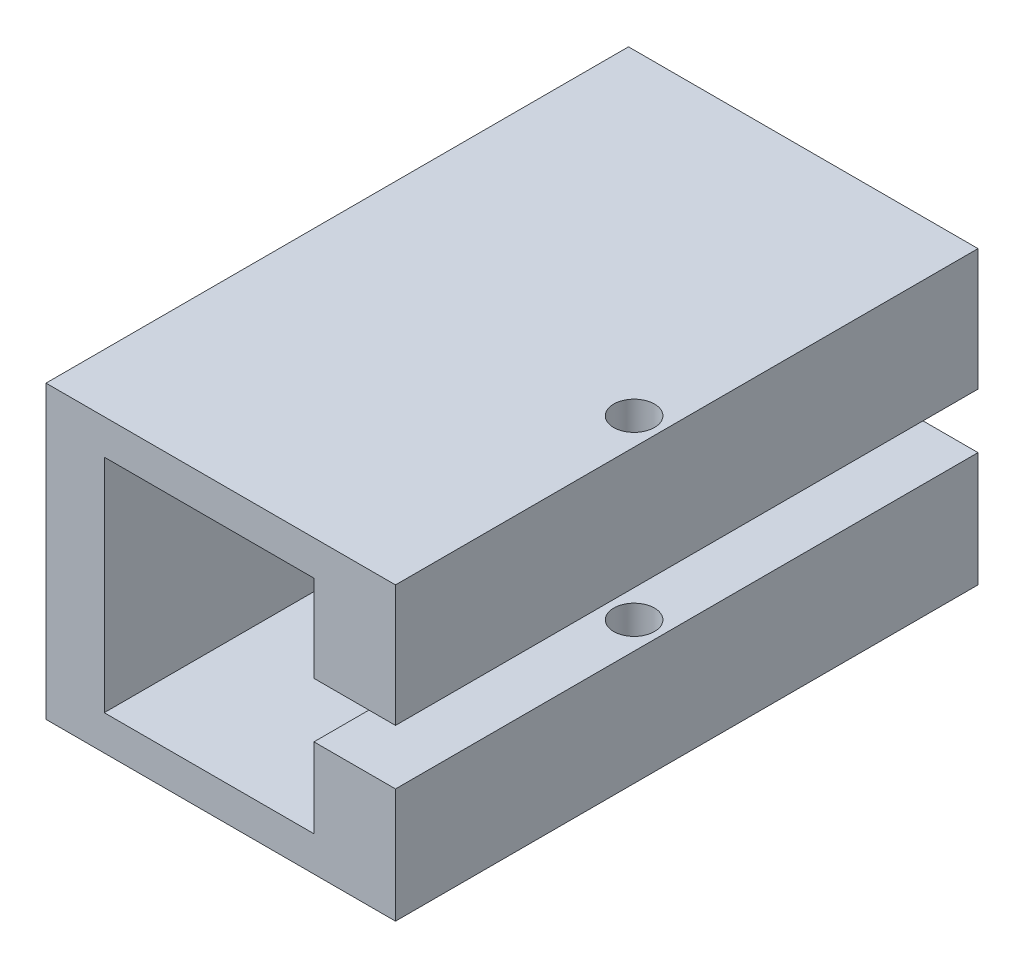
ISO-10303-21;
HEADER;
FILE_DESCRIPTION(('STEP AP214'),'2;1');
FILE_NAME('part.step','',(''),(''),'','','');
FILE_SCHEMA(('AUTOMOTIVE_DESIGN { 1 0 10303 214 1 1 1 1 }'));
ENDSEC;
DATA;
#1=APPLICATION_CONTEXT('core data for automotive mechanical design processes');
#2=APPLICATION_PROTOCOL_DEFINITION('international standard','automotive_design',2000,#1);
#3=PRODUCT_CONTEXT('',#1,'mechanical');
#4=PRODUCT('Part','Part','',(#3));
#5=PRODUCT_RELATED_PRODUCT_CATEGORY('part','',(#4));
#6=PRODUCT_DEFINITION_FORMATION('','',#4);
#7=PRODUCT_DEFINITION_CONTEXT('part definition',#1,'design');
#8=PRODUCT_DEFINITION('design','',#6,#7);
#9=PRODUCT_DEFINITION_SHAPE('','',#8);
#10=(LENGTH_UNIT() NAMED_UNIT(*) SI_UNIT(.MILLI.,.METRE.));
#11=(NAMED_UNIT(*) PLANE_ANGLE_UNIT() SI_UNIT($,.RADIAN.));
#12=(NAMED_UNIT(*) SI_UNIT($,.STERADIAN.) SOLID_ANGLE_UNIT());
#13=UNCERTAINTY_MEASURE_WITH_UNIT(LENGTH_MEASURE(1.E-05),#10,'distance_accuracy_value','');
#14=(GEOMETRIC_REPRESENTATION_CONTEXT(3) GLOBAL_UNCERTAINTY_ASSIGNED_CONTEXT((#13)) GLOBAL_UNIT_ASSIGNED_CONTEXT((#10,
#11,#12)) REPRESENTATION_CONTEXT('',''));
#15=CARTESIAN_POINT('',(0.,0.,0.));
#16=DIRECTION('',(0.,0.,1.));
#17=DIRECTION('',(1.,0.,0.));
#18=AXIS2_PLACEMENT_3D('',#15,#16,#17);
#19=CARTESIAN_POINT('',(30.,0.,50.));
#20=DIRECTION('',(0.,1.,0.));
#21=DIRECTION('',(-1.,0.,0.));
#22=AXIS2_PLACEMENT_3D('',#19,#20,#21);
#23=PLANE('',#22);
#24=CARTESIAN_POINT('',(27.668171426558,0.,27.1887416600858));
#25=DIRECTION('',(0.,1.,0.));
#26=DIRECTION('',(-1.,0.,0.));
#27=AXIS2_PLACEMENT_3D('',#24,#25,#26);
#28=CIRCLE('',#27,1.75);
#29=CARTESIAN_POINT('',(25.918171426558,0.,27.1887416600858));
#30=VERTEX_POINT('',#29);
#31=EDGE_CURVE('E377',#30,#30,#28,.T.);
#32=ORIENTED_EDGE('',*,*,#31,.T.);
#33=EDGE_LOOP('',(#32));
#34=FACE_BOUND('',#33,.T.);
#35=DIRECTION('',(1.,0.,0.));
#36=VECTOR('',#35,1.);
#37=CARTESIAN_POINT('',(30.,0.,0.));
#38=LINE('',#37,#36);
#39=CARTESIAN_POINT('',(0.,0.,0.));
#40=VERTEX_POINT('',#39);
#41=CARTESIAN_POINT('',(30.,0.,0.));
#42=VERTEX_POINT('',#41);
#43=EDGE_CURVE('E169',#40,#42,#38,.T.);
#44=ORIENTED_EDGE('',*,*,#43,.T.);
#45=DIRECTION('',(0.,0.,-1.));
#46=VECTOR('',#45,1.);
#47=CARTESIAN_POINT('',(30.,0.,50.));
#48=LINE('',#47,#46);
#49=CARTESIAN_POINT('',(30.,0.,50.));
#50=VERTEX_POINT('',#49);
#51=EDGE_CURVE('E11',#50,#42,#48,.T.);
#52=ORIENTED_EDGE('',*,*,#51,.F.);
#53=DIRECTION('',(1.,0.,0.));
#54=VECTOR('',#53,1.);
#55=CARTESIAN_POINT('',(30.,0.,50.));
#56=LINE('',#55,#54);
#57=CARTESIAN_POINT('',(0.,0.,50.));
#58=VERTEX_POINT('',#57);
#59=EDGE_CURVE('E193',#58,#50,#56,.T.);
#60=ORIENTED_EDGE('',*,*,#59,.F.);
#61=DIRECTION('',(0.,0.,-1.));
#62=VECTOR('',#61,1.);
#63=CARTESIAN_POINT('',(0.,0.,50.));
#64=LINE('',#63,#62);
#65=EDGE_CURVE('E165',#58,#40,#64,.T.);
#66=ORIENTED_EDGE('',*,*,#65,.T.);
#67=EDGE_LOOP('',(#44,#52,#60,#66));
#68=FACE_BOUND('',#67,.T.);
#69=ADVANCED_FACE('F37',(#34,#68),#23,.F.);
#70=CARTESIAN_POINT('',(30.,9.83322548531722,50.));
#71=DIRECTION('',(-1.,0.,0.));
#72=DIRECTION('',(0.,0.,1.));
#73=AXIS2_PLACEMENT_3D('',#70,#71,#72);
#74=PLANE('',#73);
#75=DIRECTION('',(0.,1.,0.));
#76=VECTOR('',#75,1.);
#77=CARTESIAN_POINT('',(30.,9.83322548531722,0.));
#78=LINE('',#77,#76);
#79=CARTESIAN_POINT('',(30.,9.83322548531722,0.));
#80=VERTEX_POINT('',#79);
#81=EDGE_CURVE('E172',#42,#80,#78,.T.);
#82=ORIENTED_EDGE('',*,*,#81,.T.);
#83=DIRECTION('',(0.,0.,-1.));
#84=VECTOR('',#83,1.);
#85=CARTESIAN_POINT('',(30.,9.83322548531722,50.));
#86=LINE('',#85,#84);
#87=CARTESIAN_POINT('',(30.,9.83322548531722,50.));
#88=VERTEX_POINT('',#87);
#89=EDGE_CURVE('E44',#88,#80,#86,.T.);
#90=ORIENTED_EDGE('',*,*,#89,.F.);
#91=DIRECTION('',(0.,1.,0.));
#92=VECTOR('',#91,1.);
#93=CARTESIAN_POINT('',(30.,9.83322548531722,50.));
#94=LINE('',#93,#92);
#95=EDGE_CURVE('E113',#50,#88,#94,.T.);
#96=ORIENTED_EDGE('',*,*,#95,.F.);
#97=ORIENTED_EDGE('',*,*,#51,.T.);
#98=EDGE_LOOP('',(#82,#90,#96,#97));
#99=FACE_BOUND('',#98,.T.);
#100=ADVANCED_FACE('F409',(#99),#74,.F.);
#101=CARTESIAN_POINT('',(23.,9.83322548531724,50.));
#102=DIRECTION('',(0.,-1.,0.));
#103=DIRECTION('',(1.,0.,0.));
#104=AXIS2_PLACEMENT_3D('',#101,#102,#103);
#105=PLANE('',#104);
#106=CARTESIAN_POINT('',(27.668171426558,9.83322548531723,27.1887416600858));
#107=DIRECTION('',(0.,-1.,0.));
#108=DIRECTION('',(1.,0.,0.));
#109=AXIS2_PLACEMENT_3D('',#106,#107,#108);
#110=CIRCLE('',#109,1.75);
#111=CARTESIAN_POINT('',(29.418171426558,9.83322548531722,27.1887416600858));
#112=VERTEX_POINT('',#111);
#113=EDGE_CURVE('E382',#112,#112,#110,.T.);
#114=ORIENTED_EDGE('',*,*,#113,.T.);
#115=EDGE_LOOP('',(#114));
#116=FACE_BOUND('',#115,.T.);
#117=DIRECTION('',(-1.,0.,0.));
#118=VECTOR('',#117,1.);
#119=CARTESIAN_POINT('',(23.,9.83322548531724,0.));
#120=LINE('',#119,#118);
#121=CARTESIAN_POINT('',(23.,9.83322548531724,0.));
#122=VERTEX_POINT('',#121);
#123=EDGE_CURVE('E175',#80,#122,#120,.T.);
#124=ORIENTED_EDGE('',*,*,#123,.T.);
#125=DIRECTION('',(0.,0.,-1.));
#126=VECTOR('',#125,1.);
#127=CARTESIAN_POINT('',(23.,9.83322548531724,50.));
#128=LINE('',#127,#126);
#129=CARTESIAN_POINT('',(23.,9.83322548531724,50.));
#130=VERTEX_POINT('',#129);
#131=EDGE_CURVE('E212',#130,#122,#128,.T.);
#132=ORIENTED_EDGE('',*,*,#131,.F.);
#133=DIRECTION('',(-1.,0.,0.));
#134=VECTOR('',#133,1.);
#135=CARTESIAN_POINT('',(23.,9.83322548531724,50.));
#136=LINE('',#135,#134);
#137=EDGE_CURVE('E220',#88,#130,#136,.T.);
#138=ORIENTED_EDGE('',*,*,#137,.F.);
#139=ORIENTED_EDGE('',*,*,#89,.T.);
#140=EDGE_LOOP('',(#124,#132,#138,#139));
#141=FACE_BOUND('',#140,.T.);
#142=ADVANCED_FACE('F218',(#116,#141),#105,.F.);
#143=CARTESIAN_POINT('',(23.,3.,50.));
#144=DIRECTION('',(1.,0.,0.));
#145=DIRECTION('',(0.,0.,-1.));
#146=AXIS2_PLACEMENT_3D('',#143,#144,#145);
#147=PLANE('',#146);
#148=DIRECTION('',(0.,-1.,0.));
#149=VECTOR('',#148,1.);
#150=CARTESIAN_POINT('',(23.,3.,0.));
#151=LINE('',#150,#149);
#152=CARTESIAN_POINT('',(23.,3.,0.));
#153=VERTEX_POINT('',#152);
#154=EDGE_CURVE('E177',#122,#153,#151,.T.);
#155=ORIENTED_EDGE('',*,*,#154,.T.);
#156=DIRECTION('',(0.,0.,-1.));
#157=VECTOR('',#156,1.);
#158=CARTESIAN_POINT('',(23.,3.,50.));
#159=LINE('',#158,#157);
#160=CARTESIAN_POINT('',(23.,3.,50.));
#161=VERTEX_POINT('',#160);
#162=EDGE_CURVE('E209',#161,#153,#159,.T.);
#163=ORIENTED_EDGE('',*,*,#162,.F.);
#164=DIRECTION('',(0.,-1.,0.));
#165=VECTOR('',#164,1.);
#166=CARTESIAN_POINT('',(23.,3.,50.));
#167=LINE('',#166,#165);
#168=EDGE_CURVE('E238',#130,#161,#167,.T.);
#169=ORIENTED_EDGE('',*,*,#168,.F.);
#170=ORIENTED_EDGE('',*,*,#131,.T.);
#171=EDGE_LOOP('',(#155,#163,#169,#170));
#172=FACE_BOUND('',#171,.T.);
#173=ADVANCED_FACE('F229',(#172),#147,.F.);
#174=CARTESIAN_POINT('',(5.,3.,50.));
#175=DIRECTION('',(0.,-1.,0.));
#176=DIRECTION('',(1.,0.,0.));
#177=AXIS2_PLACEMENT_3D('',#174,#175,#176);
#178=PLANE('',#177);
#179=DIRECTION('',(-1.,0.,0.));
#180=VECTOR('',#179,1.);
#181=CARTESIAN_POINT('',(5.,3.,0.));
#182=LINE('',#181,#180);
#183=CARTESIAN_POINT('',(5.,3.,0.));
#184=VERTEX_POINT('',#183);
#185=EDGE_CURVE('E179',#153,#184,#182,.T.);
#186=ORIENTED_EDGE('',*,*,#185,.T.);
#187=DIRECTION('',(0.,0.,-1.));
#188=VECTOR('',#187,1.);
#189=CARTESIAN_POINT('',(5.,3.,50.));
#190=LINE('',#189,#188);
#191=CARTESIAN_POINT('',(5.,3.,50.));
#192=VERTEX_POINT('',#191);
#193=EDGE_CURVE('E206',#192,#184,#190,.T.);
#194=ORIENTED_EDGE('',*,*,#193,.F.);
#195=DIRECTION('',(-1.,0.,0.));
#196=VECTOR('',#195,1.);
#197=CARTESIAN_POINT('',(5.,3.,50.));
#198=LINE('',#197,#196);
#199=EDGE_CURVE('E235',#161,#192,#198,.T.);
#200=ORIENTED_EDGE('',*,*,#199,.F.);
#201=ORIENTED_EDGE('',*,*,#162,.T.);
#202=EDGE_LOOP('',(#186,#194,#200,#201));
#203=FACE_BOUND('',#202,.T.);
#204=ADVANCED_FACE('F233',(#203),#178,.F.);
#205=CARTESIAN_POINT('',(5.,22.,50.));
#206=DIRECTION('',(-1.,0.,0.));
#207=DIRECTION('',(0.,-1.,0.));
#208=AXIS2_PLACEMENT_3D('',#205,#206,#207);
#209=PLANE('',#208);
#210=DIRECTION('',(0.,1.,0.));
#211=VECTOR('',#210,1.);
#212=CARTESIAN_POINT('',(5.,22.,0.));
#213=LINE('',#212,#211);
#214=CARTESIAN_POINT('',(5.,22.,0.));
#215=VERTEX_POINT('',#214);
#216=EDGE_CURVE('E181',#184,#215,#213,.T.);
#217=ORIENTED_EDGE('',*,*,#216,.T.);
#218=DIRECTION('',(0.,0.,-1.));
#219=VECTOR('',#218,1.);
#220=CARTESIAN_POINT('',(5.,22.,50.));
#221=LINE('',#220,#219);
#222=CARTESIAN_POINT('',(5.,22.,50.));
#223=VERTEX_POINT('',#222);
#224=EDGE_CURVE('E203',#223,#215,#221,.T.);
#225=ORIENTED_EDGE('',*,*,#224,.F.);
#226=DIRECTION('',(0.,1.,0.));
#227=VECTOR('',#226,1.);
#228=CARTESIAN_POINT('',(5.,22.,50.));
#229=LINE('',#228,#227);
#230=EDGE_CURVE('E237',#192,#223,#229,.T.);
#231=ORIENTED_EDGE('',*,*,#230,.F.);
#232=ORIENTED_EDGE('',*,*,#193,.T.);
#233=EDGE_LOOP('',(#217,#225,#231,#232));
#234=FACE_BOUND('',#233,.T.);
#235=ADVANCED_FACE('F650',(#234),#209,.F.);
#236=CARTESIAN_POINT('',(23.,22.,50.));
#237=DIRECTION('',(0.,1.,0.));
#238=DIRECTION('',(-1.,0.,0.));
#239=AXIS2_PLACEMENT_3D('',#236,#237,#238);
#240=PLANE('',#239);
#241=DIRECTION('',(1.,0.,0.));
#242=VECTOR('',#241,1.);
#243=CARTESIAN_POINT('',(23.,22.,0.));
#244=LINE('',#243,#242);
#245=CARTESIAN_POINT('',(23.,22.,0.));
#246=VERTEX_POINT('',#245);
#247=EDGE_CURVE('E183',#215,#246,#244,.T.);
#248=ORIENTED_EDGE('',*,*,#247,.T.);
#249=DIRECTION('',(0.,0.,-1.));
#250=VECTOR('',#249,1.);
#251=CARTESIAN_POINT('',(23.,22.,50.));
#252=LINE('',#251,#250);
#253=CARTESIAN_POINT('',(23.,22.,50.));
#254=VERTEX_POINT('',#253);
#255=EDGE_CURVE('E200',#254,#246,#252,.T.);
#256=ORIENTED_EDGE('',*,*,#255,.F.);
#257=DIRECTION('',(1.,0.,0.));
#258=VECTOR('',#257,1.);
#259=CARTESIAN_POINT('',(23.,22.,50.));
#260=LINE('',#259,#258);
#261=EDGE_CURVE('E240',#223,#254,#260,.T.);
#262=ORIENTED_EDGE('',*,*,#261,.F.);
#263=ORIENTED_EDGE('',*,*,#224,.T.);
#264=EDGE_LOOP('',(#248,#256,#262,#263));
#265=FACE_BOUND('',#264,.T.);
#266=ADVANCED_FACE('F642',(#265),#240,.F.);
#267=CARTESIAN_POINT('',(23.,14.5534172193059,50.));
#268=DIRECTION('',(1.,0.,0.));
#269=DIRECTION('',(0.,0.,-1.));
#270=AXIS2_PLACEMENT_3D('',#267,#268,#269);
#271=PLANE('',#270);
#272=DIRECTION('',(0.,-1.,0.));
#273=VECTOR('',#272,1.);
#274=CARTESIAN_POINT('',(23.,14.5534172193059,0.));
#275=LINE('',#274,#273);
#276=CARTESIAN_POINT('',(23.,14.5534172193059,0.));
#277=VERTEX_POINT('',#276);
#278=EDGE_CURVE('E185',#246,#277,#275,.T.);
#279=ORIENTED_EDGE('',*,*,#278,.T.);
#280=DIRECTION('',(0.,0.,-1.));
#281=VECTOR('',#280,1.);
#282=CARTESIAN_POINT('',(23.,14.5534172193059,50.));
#283=LINE('',#282,#281);
#284=CARTESIAN_POINT('',(23.,14.5534172193059,50.));
#285=VERTEX_POINT('',#284);
#286=EDGE_CURVE('E197',#285,#277,#283,.T.);
#287=ORIENTED_EDGE('',*,*,#286,.F.);
#288=DIRECTION('',(0.,-1.,0.));
#289=VECTOR('',#288,1.);
#290=CARTESIAN_POINT('',(23.,14.5534172193059,50.));
#291=LINE('',#290,#289);
#292=EDGE_CURVE('E246',#254,#285,#291,.T.);
#293=ORIENTED_EDGE('',*,*,#292,.F.);
#294=ORIENTED_EDGE('',*,*,#255,.T.);
#295=EDGE_LOOP('',(#279,#287,#293,#294));
#296=FACE_BOUND('',#295,.T.);
#297=ADVANCED_FACE('F252',(#296),#271,.F.);
#298=CARTESIAN_POINT('',(30.,14.5534172193058,50.));
#299=DIRECTION('',(0.,1.,0.));
#300=DIRECTION('',(-1.,0.,0.));
#301=AXIS2_PLACEMENT_3D('',#298,#299,#300);
#302=PLANE('',#301);
#303=CARTESIAN_POINT('',(27.668171426558,14.5534172193059,27.1887416600858));
#304=DIRECTION('',(0.,1.,0.));
#305=DIRECTION('',(-1.,0.,0.));
#306=AXIS2_PLACEMENT_3D('',#303,#304,#305);
#307=CIRCLE('',#306,1.75);
#308=CARTESIAN_POINT('',(25.918171426558,14.5534172193059,27.1887416600858));
#309=VERTEX_POINT('',#308);
#310=EDGE_CURVE('E385',#309,#309,#307,.T.);
#311=ORIENTED_EDGE('',*,*,#310,.T.);
#312=EDGE_LOOP('',(#311));
#313=FACE_BOUND('',#312,.T.);
#314=DIRECTION('',(1.,0.,0.));
#315=VECTOR('',#314,1.);
#316=CARTESIAN_POINT('',(30.,14.5534172193058,0.));
#317=LINE('',#316,#315);
#318=CARTESIAN_POINT('',(30.,14.5534172193058,0.));
#319=VERTEX_POINT('',#318);
#320=EDGE_CURVE('E187',#277,#319,#317,.T.);
#321=ORIENTED_EDGE('',*,*,#320,.T.);
#322=DIRECTION('',(0.,0.,-1.));
#323=VECTOR('',#322,1.);
#324=CARTESIAN_POINT('',(30.,14.5534172193058,50.));
#325=LINE('',#324,#323);
#326=CARTESIAN_POINT('',(30.,14.5534172193058,50.));
#327=VERTEX_POINT('',#326);
#328=EDGE_CURVE('E160',#327,#319,#325,.T.);
#329=ORIENTED_EDGE('',*,*,#328,.F.);
#330=DIRECTION('',(1.,0.,0.));
#331=VECTOR('',#330,1.);
#332=CARTESIAN_POINT('',(30.,14.5534172193058,50.));
#333=LINE('',#332,#331);
#334=EDGE_CURVE('E148',#285,#327,#333,.T.);
#335=ORIENTED_EDGE('',*,*,#334,.F.);
#336=ORIENTED_EDGE('',*,*,#286,.T.);
#337=EDGE_LOOP('',(#321,#329,#335,#336));
#338=FACE_BOUND('',#337,.T.);
#339=ADVANCED_FACE('F256',(#313,#338),#302,.F.);
#340=CARTESIAN_POINT('',(30.,25.,50.));
#341=DIRECTION('',(-1.,0.,0.));
#342=DIRECTION('',(0.,0.,1.));
#343=AXIS2_PLACEMENT_3D('',#340,#341,#342);
#344=PLANE('',#343);
#345=DIRECTION('',(0.,1.,0.));
#346=VECTOR('',#345,1.);
#347=CARTESIAN_POINT('',(30.,25.,0.));
#348=LINE('',#347,#346);
#349=CARTESIAN_POINT('',(30.,25.,0.));
#350=VERTEX_POINT('',#349);
#351=EDGE_CURVE('E157',#319,#350,#348,.T.);
#352=ORIENTED_EDGE('',*,*,#351,.T.);
#353=DIRECTION('',(0.,0.,-1.));
#354=VECTOR('',#353,1.);
#355=CARTESIAN_POINT('',(30.,25.,50.));
#356=LINE('',#355,#354);
#357=CARTESIAN_POINT('',(30.,25.,50.));
#358=VERTEX_POINT('',#357);
#359=EDGE_CURVE('E154',#358,#350,#356,.T.);
#360=ORIENTED_EDGE('',*,*,#359,.F.);
#361=DIRECTION('',(0.,1.,0.));
#362=VECTOR('',#361,1.);
#363=CARTESIAN_POINT('',(30.,25.,50.));
#364=LINE('',#363,#362);
#365=EDGE_CURVE('E141',#327,#358,#364,.T.);
#366=ORIENTED_EDGE('',*,*,#365,.F.);
#367=ORIENTED_EDGE('',*,*,#328,.T.);
#368=EDGE_LOOP('',(#352,#360,#366,#367));
#369=FACE_BOUND('',#368,.T.);
#370=ADVANCED_FACE('F155',(#369),#344,.F.);
#371=CARTESIAN_POINT('',(0.,25.,50.));
#372=DIRECTION('',(0.,-1.,0.));
#373=DIRECTION('',(0.,0.,-1.));
#374=AXIS2_PLACEMENT_3D('',#371,#372,#373);
#375=PLANE('',#374);
#376=CARTESIAN_POINT('',(27.668171426558,25.,27.1887416600858));
#377=DIRECTION('',(0.,1.,0.));
#378=DIRECTION('',(0.,0.,1.));
#379=AXIS2_PLACEMENT_3D('',#376,#377,#378);
#380=CIRCLE('',#379,1.75);
#381=CARTESIAN_POINT('',(27.668171426558,25.,28.9387416600858));
#382=VERTEX_POINT('',#381);
#383=EDGE_CURVE('E388',#382,#382,#380,.T.);
#384=ORIENTED_EDGE('',*,*,#383,.F.);
#385=EDGE_LOOP('',(#384));
#386=FACE_BOUND('',#385,.T.);
#387=DIRECTION('',(-1.,0.,0.));
#388=VECTOR('',#387,1.);
#389=CARTESIAN_POINT('',(0.,25.,0.));
#390=LINE('',#389,#388);
#391=CARTESIAN_POINT('',(0.,25.,0.));
#392=VERTEX_POINT('',#391);
#393=EDGE_CURVE('E190',#350,#392,#390,.T.);
#394=ORIENTED_EDGE('',*,*,#393,.T.);
#395=DIRECTION('',(0.,0.,-1.));
#396=VECTOR('',#395,1.);
#397=CARTESIAN_POINT('',(0.,25.,50.));
#398=LINE('',#397,#396);
#399=CARTESIAN_POINT('',(0.,25.,50.));
#400=VERTEX_POINT('',#399);
#401=EDGE_CURVE('E161',#400,#392,#398,.T.);
#402=ORIENTED_EDGE('',*,*,#401,.F.);
#403=DIRECTION('',(-1.,0.,0.));
#404=VECTOR('',#403,1.);
#405=CARTESIAN_POINT('',(0.,25.,50.));
#406=LINE('',#405,#404);
#407=EDGE_CURVE('E145',#358,#400,#406,.T.);
#408=ORIENTED_EDGE('',*,*,#407,.F.);
#409=ORIENTED_EDGE('',*,*,#359,.T.);
#410=EDGE_LOOP('',(#394,#402,#408,#409));
#411=FACE_BOUND('',#410,.T.);
#412=ADVANCED_FACE('F163',(#386,#411),#375,.F.);
#413=CARTESIAN_POINT('',(0.,0.,50.));
#414=DIRECTION('',(1.,0.,0.));
#415=DIRECTION('',(0.,0.,-1.));
#416=AXIS2_PLACEMENT_3D('',#413,#414,#415);
#417=PLANE('',#416);
#418=DIRECTION('',(0.,0.,1.));
#419=VECTOR('',#418,1.);
#420=CARTESIAN_POINT('',(0.,9.05670551944764,21.9194721479017));
#421=LINE('',#420,#419);
#422=CARTESIAN_POINT('',(0.,9.05670551944764,4.91947214790173));
#423=VERTEX_POINT('',#422);
#424=CARTESIAN_POINT('',(0.,9.05670551944764,21.9194721479017));
#425=VERTEX_POINT('',#424);
#426=EDGE_CURVE('E329',#423,#425,#421,.T.);
#427=ORIENTED_EDGE('',*,*,#426,.F.);
#428=DIRECTION('',(0.,-1.,0.));
#429=VECTOR('',#428,1.);
#430=CARTESIAN_POINT('',(0.,16.0567055194476,4.91947214790173));
#431=LINE('',#430,#429);
#432=CARTESIAN_POINT('',(0.,16.0567055194476,4.91947214790173));
#433=VERTEX_POINT('',#432);
#434=EDGE_CURVE('E51',#433,#423,#431,.T.);
#435=ORIENTED_EDGE('',*,*,#434,.F.);
#436=DIRECTION('',(0.,0.,-1.));
#437=VECTOR('',#436,1.);
#438=CARTESIAN_POINT('',(0.,16.0567055194476,4.91947214790173));
#439=LINE('',#438,#437);
#440=CARTESIAN_POINT('',(0.,16.0567055194476,21.9194721479017));
#441=VERTEX_POINT('',#440);
#442=EDGE_CURVE('E298',#441,#433,#439,.T.);
#443=ORIENTED_EDGE('',*,*,#442,.F.);
#444=DIRECTION('',(0.,-1.,0.));
#445=VECTOR('',#444,1.);
#446=CARTESIAN_POINT('',(0.,16.0567055194476,21.9194721479017));
#447=LINE('',#446,#445);
#448=CARTESIAN_POINT('',(0.,24.0567055194476,21.9194721479017));
#449=VERTEX_POINT('',#448);
#450=EDGE_CURVE('E302',#449,#441,#447,.T.);
#451=ORIENTED_EDGE('',*,*,#450,.F.);
#452=DIRECTION('',(0.,0.,-1.));
#453=VECTOR('',#452,1.);
#454=CARTESIAN_POINT('',(0.,24.0567055194476,21.9194721479017));
#455=LINE('',#454,#453);
#456=CARTESIAN_POINT('',(0.,24.0567055194476,27.9194721479017));
#457=VERTEX_POINT('',#456);
#458=EDGE_CURVE('E305',#457,#449,#455,.T.);
#459=ORIENTED_EDGE('',*,*,#458,.F.);
#460=DIRECTION('',(0.,1.,0.));
#461=VECTOR('',#460,1.);
#462=CARTESIAN_POINT('',(0.,24.0567055194476,27.9194721479017));
#463=LINE('',#462,#461);
#464=CARTESIAN_POINT('',(0.,16.0567055194476,27.9194721479017));
#465=VERTEX_POINT('',#464);
#466=EDGE_CURVE('E308',#465,#457,#463,.T.);
#467=ORIENTED_EDGE('',*,*,#466,.F.);
#468=DIRECTION('',(0.,0.,-1.));
#469=VECTOR('',#468,1.);
#470=CARTESIAN_POINT('',(0.,16.0567055194476,27.9194721479017));
#471=LINE('',#470,#469);
#472=CARTESIAN_POINT('',(0.,16.0567055194476,42.9194721479017));
#473=VERTEX_POINT('',#472);
#474=EDGE_CURVE('E311',#473,#465,#471,.T.);
#475=ORIENTED_EDGE('',*,*,#474,.F.);
#476=DIRECTION('',(0.,1.,0.));
#477=VECTOR('',#476,1.);
#478=CARTESIAN_POINT('',(0.,16.0567055194476,42.9194721479017));
#479=LINE('',#478,#477);
#480=CARTESIAN_POINT('',(0.,9.05670551944765,42.9194721479017));
#481=VERTEX_POINT('',#480);
#482=EDGE_CURVE('E314',#481,#473,#479,.T.);
#483=ORIENTED_EDGE('',*,*,#482,.F.);
#484=DIRECTION('',(0.,0.,1.));
#485=VECTOR('',#484,1.);
#486=CARTESIAN_POINT('',(0.,9.05670551944765,42.9194721479017));
#487=LINE('',#486,#485);
#488=CARTESIAN_POINT('',(0.,9.05670551944765,27.9194721479017));
#489=VERTEX_POINT('',#488);
#490=EDGE_CURVE('E317',#489,#481,#487,.T.);
#491=ORIENTED_EDGE('',*,*,#490,.F.);
#492=DIRECTION('',(0.,1.,0.));
#493=VECTOR('',#492,1.);
#494=CARTESIAN_POINT('',(0.,9.05670551944765,27.9194721479017));
#495=LINE('',#494,#493);
#496=CARTESIAN_POINT('',(0.,1.05670551944765,27.9194721479017));
#497=VERTEX_POINT('',#496);
#498=EDGE_CURVE('E320',#497,#489,#495,.T.);
#499=ORIENTED_EDGE('',*,*,#498,.F.);
#500=DIRECTION('',(0.,0.,1.));
#501=VECTOR('',#500,1.);
#502=CARTESIAN_POINT('',(0.,1.05670551944765,27.9194721479017));
#503=LINE('',#502,#501);
#504=CARTESIAN_POINT('',(0.,1.05670551944765,21.9194721479017));
#505=VERTEX_POINT('',#504);
#506=EDGE_CURVE('E323',#505,#497,#503,.T.);
#507=ORIENTED_EDGE('',*,*,#506,.F.);
#508=DIRECTION('',(0.,-1.,0.));
#509=VECTOR('',#508,1.);
#510=CARTESIAN_POINT('',(0.,1.05670551944765,21.9194721479017));
#511=LINE('',#510,#509);
#512=EDGE_CURVE('E326',#425,#505,#511,.T.);
#513=ORIENTED_EDGE('',*,*,#512,.F.);
#514=EDGE_LOOP('',(#427,#435,#443,#451,#459,#467,#475,#483,#491,#499,#507,#513));
#515=FACE_BOUND('',#514,.T.);
#516=DIRECTION('',(0.,-1.,0.));
#517=VECTOR('',#516,1.);
#518=CARTESIAN_POINT('',(0.,0.,0.));
#519=LINE('',#518,#517);
#520=EDGE_CURVE('E105',#392,#40,#519,.T.);
#521=ORIENTED_EDGE('',*,*,#520,.T.);
#522=ORIENTED_EDGE('',*,*,#65,.F.);
#523=DIRECTION('',(0.,-1.,0.));
#524=VECTOR('',#523,1.);
#525=CARTESIAN_POINT('',(0.,0.,50.));
#526=LINE('',#525,#524);
#527=EDGE_CURVE('E60',#400,#58,#526,.T.);
#528=ORIENTED_EDGE('',*,*,#527,.F.);
#529=ORIENTED_EDGE('',*,*,#401,.T.);
#530=EDGE_LOOP('',(#521,#522,#528,#529));
#531=FACE_BOUND('',#530,.T.);
#532=ADVANCED_FACE('F257',(#515,#531),#417,.F.);
#533=CARTESIAN_POINT('',(0.,0.,50.));
#534=DIRECTION('',(0.,0.,-1.));
#535=DIRECTION('',(-1.,0.,0.));
#536=AXIS2_PLACEMENT_3D('',#533,#534,#535);
#537=PLANE('',#536);
#538=ORIENTED_EDGE('',*,*,#59,.T.);
#539=ORIENTED_EDGE('',*,*,#95,.T.);
#540=ORIENTED_EDGE('',*,*,#137,.T.);
#541=ORIENTED_EDGE('',*,*,#168,.T.);
#542=ORIENTED_EDGE('',*,*,#199,.T.);
#543=ORIENTED_EDGE('',*,*,#230,.T.);
#544=ORIENTED_EDGE('',*,*,#261,.T.);
#545=ORIENTED_EDGE('',*,*,#292,.T.);
#546=ORIENTED_EDGE('',*,*,#334,.T.);
#547=ORIENTED_EDGE('',*,*,#365,.T.);
#548=ORIENTED_EDGE('',*,*,#407,.T.);
#549=ORIENTED_EDGE('',*,*,#527,.T.);
#550=EDGE_LOOP('',(#538,#539,#540,#541,#542,#543,#544,#545,#546,#547,#548,#549));
#551=FACE_BOUND('',#550,.T.);
#552=ADVANCED_FACE('F143',(#551),#537,.F.);
#553=CARTESIAN_POINT('',(0.,0.,0.));
#554=DIRECTION('',(0.,0.,-1.));
#555=DIRECTION('',(-1.,0.,0.));
#556=AXIS2_PLACEMENT_3D('',#553,#554,#555);
#557=PLANE('',#556);
#558=ORIENTED_EDGE('',*,*,#43,.F.);
#559=ORIENTED_EDGE('',*,*,#520,.F.);
#560=ORIENTED_EDGE('',*,*,#393,.F.);
#561=ORIENTED_EDGE('',*,*,#351,.F.);
#562=ORIENTED_EDGE('',*,*,#320,.F.);
#563=ORIENTED_EDGE('',*,*,#278,.F.);
#564=ORIENTED_EDGE('',*,*,#247,.F.);
#565=ORIENTED_EDGE('',*,*,#216,.F.);
#566=ORIENTED_EDGE('',*,*,#185,.F.);
#567=ORIENTED_EDGE('',*,*,#154,.F.);
#568=ORIENTED_EDGE('',*,*,#123,.F.);
#569=ORIENTED_EDGE('',*,*,#81,.F.);
#570=EDGE_LOOP('',(#558,#559,#560,#561,#562,#563,#564,#565,#566,#567,#568,#569));
#571=FACE_BOUND('',#570,.T.);
#572=ADVANCED_FACE('F224',(#571),#557,.T.);
#573=CARTESIAN_POINT('',(2.99999999999999,16.0567055194476,4.91947214790173));
#574=DIRECTION('',(0.,0.,-1.));
#575=DIRECTION('',(-1.,0.,0.));
#576=AXIS2_PLACEMENT_3D('',#573,#574,#575);
#577=PLANE('',#576);
#578=ORIENTED_EDGE('',*,*,#434,.T.);
#579=DIRECTION('',(-1.,0.,0.));
#580=VECTOR('',#579,1.);
#581=CARTESIAN_POINT('',(2.99999999999999,9.05670551944764,4.91947214790173));
#582=LINE('',#581,#580);
#583=CARTESIAN_POINT('',(2.99999999999999,9.05670551944764,4.91947214790173));
#584=VERTEX_POINT('',#583);
#585=EDGE_CURVE('E264',#584,#423,#582,.T.);
#586=ORIENTED_EDGE('',*,*,#585,.F.);
#587=DIRECTION('',(0.,-1.,0.));
#588=VECTOR('',#587,1.);
#589=CARTESIAN_POINT('',(2.99999999999999,16.0567055194476,4.91947214790173));
#590=LINE('',#589,#588);
#591=CARTESIAN_POINT('',(2.99999999999999,16.0567055194476,4.91947214790173));
#592=VERTEX_POINT('',#591);
#593=EDGE_CURVE('E301',#592,#584,#590,.T.);
#594=ORIENTED_EDGE('',*,*,#593,.F.);
#595=DIRECTION('',(-1.,0.,0.));
#596=VECTOR('',#595,1.);
#597=CARTESIAN_POINT('',(2.99999999999999,16.0567055194476,4.91947214790173));
#598=LINE('',#597,#596);
#599=EDGE_CURVE('E173',#592,#433,#598,.T.);
#600=ORIENTED_EDGE('',*,*,#599,.T.);
#601=EDGE_LOOP('',(#578,#586,#594,#600));
#602=FACE_BOUND('',#601,.T.);
#603=ADVANCED_FACE('F444',(#602),#577,.F.);
#604=CARTESIAN_POINT('',(2.99999999999999,16.0567055194476,4.91947214790173));
#605=DIRECTION('',(0.,1.,0.));
#606=DIRECTION('',(0.,0.,1.));
#607=AXIS2_PLACEMENT_3D('',#604,#605,#606);
#608=PLANE('',#607);
#609=ORIENTED_EDGE('',*,*,#442,.T.);
#610=ORIENTED_EDGE('',*,*,#599,.F.);
#611=DIRECTION('',(0.,0.,-1.));
#612=VECTOR('',#611,1.);
#613=CARTESIAN_POINT('',(2.99999999999999,16.0567055194476,4.91947214790173));
#614=LINE('',#613,#612);
#615=CARTESIAN_POINT('',(2.99999999999999,16.0567055194476,21.9194721479017));
#616=VERTEX_POINT('',#615);
#617=EDGE_CURVE('E267',#616,#592,#614,.T.);
#618=ORIENTED_EDGE('',*,*,#617,.F.);
#619=DIRECTION('',(-1.,0.,0.));
#620=VECTOR('',#619,1.);
#621=CARTESIAN_POINT('',(2.99999999999999,16.0567055194476,21.9194721479017));
#622=LINE('',#621,#620);
#623=EDGE_CURVE('E294',#616,#441,#622,.T.);
#624=ORIENTED_EDGE('',*,*,#623,.T.);
#625=EDGE_LOOP('',(#609,#610,#618,#624));
#626=FACE_BOUND('',#625,.T.);
#627=ADVANCED_FACE('F440',(#626),#608,.F.);
#628=CARTESIAN_POINT('',(2.99999999999999,16.0567055194476,21.9194721479017));
#629=DIRECTION('',(0.,0.,-1.));
#630=DIRECTION('',(-1.,0.,0.));
#631=AXIS2_PLACEMENT_3D('',#628,#629,#630);
#632=PLANE('',#631);
#633=ORIENTED_EDGE('',*,*,#450,.T.);
#634=ORIENTED_EDGE('',*,*,#623,.F.);
#635=DIRECTION('',(0.,-1.,0.));
#636=VECTOR('',#635,1.);
#637=CARTESIAN_POINT('',(2.99999999999999,16.0567055194476,21.9194721479017));
#638=LINE('',#637,#636);
#639=CARTESIAN_POINT('',(2.99999999999999,24.0567055194476,21.9194721479017));
#640=VERTEX_POINT('',#639);
#641=EDGE_CURVE('E336',#640,#616,#638,.T.);
#642=ORIENTED_EDGE('',*,*,#641,.F.);
#643=DIRECTION('',(-1.,0.,0.));
#644=VECTOR('',#643,1.);
#645=CARTESIAN_POINT('',(2.99999999999999,24.0567055194476,21.9194721479017));
#646=LINE('',#645,#644);
#647=EDGE_CURVE('E291',#640,#449,#646,.T.);
#648=ORIENTED_EDGE('',*,*,#647,.T.);
#649=EDGE_LOOP('',(#633,#634,#642,#648));
#650=FACE_BOUND('',#649,.T.);
#651=ADVANCED_FACE('F443',(#650),#632,.F.);
#652=CARTESIAN_POINT('',(2.99999999999999,24.0567055194476,21.9194721479017));
#653=DIRECTION('',(0.,1.,0.));
#654=DIRECTION('',(0.,0.,1.));
#655=AXIS2_PLACEMENT_3D('',#652,#653,#654);
#656=PLANE('',#655);
#657=ORIENTED_EDGE('',*,*,#458,.T.);
#658=ORIENTED_EDGE('',*,*,#647,.F.);
#659=DIRECTION('',(0.,0.,-1.));
#660=VECTOR('',#659,1.);
#661=CARTESIAN_POINT('',(2.99999999999999,24.0567055194476,21.9194721479017));
#662=LINE('',#661,#660);
#663=CARTESIAN_POINT('',(2.99999999999999,24.0567055194476,27.9194721479017));
#664=VERTEX_POINT('',#663);
#665=EDGE_CURVE('E339',#664,#640,#662,.T.);
#666=ORIENTED_EDGE('',*,*,#665,.F.);
#667=DIRECTION('',(-1.,0.,0.));
#668=VECTOR('',#667,1.);
#669=CARTESIAN_POINT('',(2.99999999999999,24.0567055194476,27.9194721479017));
#670=LINE('',#669,#668);
#671=EDGE_CURVE('E288',#664,#457,#670,.T.);
#672=ORIENTED_EDGE('',*,*,#671,.T.);
#673=EDGE_LOOP('',(#657,#658,#666,#672));
#674=FACE_BOUND('',#673,.T.);
#675=ADVANCED_FACE('F448',(#674),#656,.F.);
#676=CARTESIAN_POINT('',(2.99999999999999,24.0567055194476,27.9194721479017));
#677=DIRECTION('',(0.,0.,1.));
#678=DIRECTION('',(1.,0.,0.));
#679=AXIS2_PLACEMENT_3D('',#676,#677,#678);
#680=PLANE('',#679);
#681=ORIENTED_EDGE('',*,*,#466,.T.);
#682=ORIENTED_EDGE('',*,*,#671,.F.);
#683=DIRECTION('',(0.,1.,0.));
#684=VECTOR('',#683,1.);
#685=CARTESIAN_POINT('',(2.99999999999999,24.0567055194476,27.9194721479017));
#686=LINE('',#685,#684);
#687=CARTESIAN_POINT('',(2.99999999999999,16.0567055194476,27.9194721479017));
#688=VERTEX_POINT('',#687);
#689=EDGE_CURVE('E342',#688,#664,#686,.T.);
#690=ORIENTED_EDGE('',*,*,#689,.F.);
#691=DIRECTION('',(-1.,0.,0.));
#692=VECTOR('',#691,1.);
#693=CARTESIAN_POINT('',(2.99999999999999,16.0567055194476,27.9194721479017));
#694=LINE('',#693,#692);
#695=EDGE_CURVE('E285',#688,#465,#694,.T.);
#696=ORIENTED_EDGE('',*,*,#695,.T.);
#697=EDGE_LOOP('',(#681,#682,#690,#696));
#698=FACE_BOUND('',#697,.T.);
#699=ADVANCED_FACE('F452',(#698),#680,.F.);
#700=CARTESIAN_POINT('',(2.99999999999999,16.0567055194476,27.9194721479017));
#701=DIRECTION('',(0.,1.,0.));
#702=DIRECTION('',(0.,0.,1.));
#703=AXIS2_PLACEMENT_3D('',#700,#701,#702);
#704=PLANE('',#703);
#705=ORIENTED_EDGE('',*,*,#474,.T.);
#706=ORIENTED_EDGE('',*,*,#695,.F.);
#707=DIRECTION('',(0.,0.,-1.));
#708=VECTOR('',#707,1.);
#709=CARTESIAN_POINT('',(2.99999999999999,16.0567055194476,27.9194721479017));
#710=LINE('',#709,#708);
#711=CARTESIAN_POINT('',(2.99999999999999,16.0567055194476,42.9194721479017));
#712=VERTEX_POINT('',#711);
#713=EDGE_CURVE('E345',#712,#688,#710,.T.);
#714=ORIENTED_EDGE('',*,*,#713,.F.);
#715=DIRECTION('',(-1.,0.,0.));
#716=VECTOR('',#715,1.);
#717=CARTESIAN_POINT('',(2.99999999999999,16.0567055194476,42.9194721479017));
#718=LINE('',#717,#716);
#719=EDGE_CURVE('E282',#712,#473,#718,.T.);
#720=ORIENTED_EDGE('',*,*,#719,.T.);
#721=EDGE_LOOP('',(#705,#706,#714,#720));
#722=FACE_BOUND('',#721,.T.);
#723=ADVANCED_FACE('F456',(#722),#704,.F.);
#724=CARTESIAN_POINT('',(2.99999999999999,16.0567055194476,42.9194721479017));
#725=DIRECTION('',(0.,0.,1.));
#726=DIRECTION('',(0.,-1.,0.));
#727=AXIS2_PLACEMENT_3D('',#724,#725,#726);
#728=PLANE('',#727);
#729=ORIENTED_EDGE('',*,*,#482,.T.);
#730=ORIENTED_EDGE('',*,*,#719,.F.);
#731=DIRECTION('',(0.,1.,0.));
#732=VECTOR('',#731,1.);
#733=CARTESIAN_POINT('',(2.99999999999999,16.0567055194476,42.9194721479017));
#734=LINE('',#733,#732);
#735=CARTESIAN_POINT('',(2.99999999999999,9.05670551944765,42.9194721479017));
#736=VERTEX_POINT('',#735);
#737=EDGE_CURVE('E348',#736,#712,#734,.T.);
#738=ORIENTED_EDGE('',*,*,#737,.F.);
#739=DIRECTION('',(-1.,0.,0.));
#740=VECTOR('',#739,1.);
#741=CARTESIAN_POINT('',(2.99999999999999,9.05670551944765,42.9194721479017));
#742=LINE('',#741,#740);
#743=EDGE_CURVE('E279',#736,#481,#742,.T.);
#744=ORIENTED_EDGE('',*,*,#743,.T.);
#745=EDGE_LOOP('',(#729,#730,#738,#744));
#746=FACE_BOUND('',#745,.T.);
#747=ADVANCED_FACE('F460',(#746),#728,.F.);
#748=CARTESIAN_POINT('',(2.99999999999999,9.05670551944765,42.9194721479017));
#749=DIRECTION('',(0.,-1.,0.));
#750=DIRECTION('',(0.,0.,-1.));
#751=AXIS2_PLACEMENT_3D('',#748,#749,#750);
#752=PLANE('',#751);
#753=ORIENTED_EDGE('',*,*,#490,.T.);
#754=ORIENTED_EDGE('',*,*,#743,.F.);
#755=DIRECTION('',(0.,0.,1.));
#756=VECTOR('',#755,1.);
#757=CARTESIAN_POINT('',(2.99999999999999,9.05670551944765,42.9194721479017));
#758=LINE('',#757,#756);
#759=CARTESIAN_POINT('',(2.99999999999999,9.05670551944765,27.9194721479017));
#760=VERTEX_POINT('',#759);
#761=EDGE_CURVE('E351',#760,#736,#758,.T.);
#762=ORIENTED_EDGE('',*,*,#761,.F.);
#763=DIRECTION('',(-1.,0.,0.));
#764=VECTOR('',#763,1.);
#765=CARTESIAN_POINT('',(2.99999999999999,9.05670551944765,27.9194721479017));
#766=LINE('',#765,#764);
#767=EDGE_CURVE('E276',#760,#489,#766,.T.);
#768=ORIENTED_EDGE('',*,*,#767,.T.);
#769=EDGE_LOOP('',(#753,#754,#762,#768));
#770=FACE_BOUND('',#769,.T.);
#771=ADVANCED_FACE('F464',(#770),#752,.F.);
#772=CARTESIAN_POINT('',(2.99999999999999,9.05670551944765,27.9194721479017));
#773=DIRECTION('',(0.,0.,1.));
#774=DIRECTION('',(1.,0.,0.));
#775=AXIS2_PLACEMENT_3D('',#772,#773,#774);
#776=PLANE('',#775);
#777=ORIENTED_EDGE('',*,*,#498,.T.);
#778=ORIENTED_EDGE('',*,*,#767,.F.);
#779=DIRECTION('',(0.,1.,0.));
#780=VECTOR('',#779,1.);
#781=CARTESIAN_POINT('',(2.99999999999999,9.05670551944765,27.9194721479017));
#782=LINE('',#781,#780);
#783=CARTESIAN_POINT('',(2.99999999999999,1.05670551944765,27.9194721479017));
#784=VERTEX_POINT('',#783);
#785=EDGE_CURVE('E354',#784,#760,#782,.T.);
#786=ORIENTED_EDGE('',*,*,#785,.F.);
#787=DIRECTION('',(-1.,0.,0.));
#788=VECTOR('',#787,1.);
#789=CARTESIAN_POINT('',(2.99999999999999,1.05670551944765,27.9194721479017));
#790=LINE('',#789,#788);
#791=EDGE_CURVE('E273',#784,#497,#790,.T.);
#792=ORIENTED_EDGE('',*,*,#791,.T.);
#793=EDGE_LOOP('',(#777,#778,#786,#792));
#794=FACE_BOUND('',#793,.T.);
#795=ADVANCED_FACE('F468',(#794),#776,.F.);
#796=CARTESIAN_POINT('',(2.99999999999999,1.05670551944765,27.9194721479017));
#797=DIRECTION('',(0.,-1.,0.));
#798=DIRECTION('',(0.,0.,-1.));
#799=AXIS2_PLACEMENT_3D('',#796,#797,#798);
#800=PLANE('',#799);
#801=ORIENTED_EDGE('',*,*,#506,.T.);
#802=ORIENTED_EDGE('',*,*,#791,.F.);
#803=DIRECTION('',(0.,0.,1.));
#804=VECTOR('',#803,1.);
#805=CARTESIAN_POINT('',(2.99999999999999,1.05670551944765,27.9194721479017));
#806=LINE('',#805,#804);
#807=CARTESIAN_POINT('',(2.99999999999999,1.05670551944765,21.9194721479017));
#808=VERTEX_POINT('',#807);
#809=EDGE_CURVE('E357',#808,#784,#806,.T.);
#810=ORIENTED_EDGE('',*,*,#809,.F.);
#811=DIRECTION('',(-1.,0.,0.));
#812=VECTOR('',#811,1.);
#813=CARTESIAN_POINT('',(2.99999999999999,1.05670551944765,21.9194721479017));
#814=LINE('',#813,#812);
#815=EDGE_CURVE('E270',#808,#505,#814,.T.);
#816=ORIENTED_EDGE('',*,*,#815,.T.);
#817=EDGE_LOOP('',(#801,#802,#810,#816));
#818=FACE_BOUND('',#817,.T.);
#819=ADVANCED_FACE('F472',(#818),#800,.F.);
#820=CARTESIAN_POINT('',(2.99999999999999,1.05670551944765,21.9194721479017));
#821=DIRECTION('',(0.,0.,-1.));
#822=DIRECTION('',(0.,1.,0.));
#823=AXIS2_PLACEMENT_3D('',#820,#821,#822);
#824=PLANE('',#823);
#825=ORIENTED_EDGE('',*,*,#512,.T.);
#826=ORIENTED_EDGE('',*,*,#815,.F.);
#827=DIRECTION('',(0.,-1.,0.));
#828=VECTOR('',#827,1.);
#829=CARTESIAN_POINT('',(2.99999999999999,1.05670551944765,21.9194721479017));
#830=LINE('',#829,#828);
#831=CARTESIAN_POINT('',(2.99999999999999,9.05670551944764,21.9194721479017));
#832=VERTEX_POINT('',#831);
#833=EDGE_CURVE('E360',#832,#808,#830,.T.);
#834=ORIENTED_EDGE('',*,*,#833,.F.);
#835=DIRECTION('',(-1.,0.,0.));
#836=VECTOR('',#835,1.);
#837=CARTESIAN_POINT('',(2.99999999999999,9.05670551944764,21.9194721479017));
#838=LINE('',#837,#836);
#839=EDGE_CURVE('E266',#832,#425,#838,.T.);
#840=ORIENTED_EDGE('',*,*,#839,.T.);
#841=EDGE_LOOP('',(#825,#826,#834,#840));
#842=FACE_BOUND('',#841,.T.);
#843=ADVANCED_FACE('F476',(#842),#824,.F.);
#844=CARTESIAN_POINT('',(2.99999999999999,9.05670551944764,21.9194721479017));
#845=DIRECTION('',(0.,-1.,0.));
#846=DIRECTION('',(0.,0.,-1.));
#847=AXIS2_PLACEMENT_3D('',#844,#845,#846);
#848=PLANE('',#847);
#849=ORIENTED_EDGE('',*,*,#426,.T.);
#850=ORIENTED_EDGE('',*,*,#839,.F.);
#851=DIRECTION('',(0.,0.,1.));
#852=VECTOR('',#851,1.);
#853=CARTESIAN_POINT('',(2.99999999999999,9.05670551944764,21.9194721479017));
#854=LINE('',#853,#852);
#855=EDGE_CURVE('E363',#584,#832,#854,.T.);
#856=ORIENTED_EDGE('',*,*,#855,.F.);
#857=ORIENTED_EDGE('',*,*,#585,.T.);
#858=EDGE_LOOP('',(#849,#850,#856,#857));
#859=FACE_BOUND('',#858,.T.);
#860=ADVANCED_FACE('F438',(#859),#848,.F.);
#861=CARTESIAN_POINT('',(2.99999999999999,0.,0.));
#862=DIRECTION('',(1.,0.,0.));
#863=DIRECTION('',(0.,0.,-1.));
#864=AXIS2_PLACEMENT_3D('',#861,#862,#863);
#865=PLANE('',#864);
#866=CARTESIAN_POINT('',(2.99999999999999,12.5203126419566,8.98022405824196));
#867=DIRECTION('',(-1.,0.,0.));
#868=DIRECTION('',(0.,0.,1.));
#869=AXIS2_PLACEMENT_3D('',#866,#867,#868);
#870=CIRCLE('',#869,0.55);
#871=CARTESIAN_POINT('',(2.99999999999999,12.5203126419566,9.53022405824196));
#872=VERTEX_POINT('',#871);
#873=EDGE_CURVE('E371',#872,#872,#870,.T.);
#874=ORIENTED_EDGE('',*,*,#873,.F.);
#875=EDGE_LOOP('',(#874));
#876=FACE_BOUND('',#875,.T.);
#877=CARTESIAN_POINT('',(2.99999999999999,12.5203126419566,40.25));
#878=DIRECTION('',(-1.,0.,0.));
#879=DIRECTION('',(0.,0.,1.));
#880=AXIS2_PLACEMENT_3D('',#877,#878,#879);
#881=CIRCLE('',#880,0.550000000000003);
#882=CARTESIAN_POINT('',(2.99999999999999,12.5203126419566,40.8));
#883=VERTEX_POINT('',#882);
#884=EDGE_CURVE('E333',#883,#883,#881,.T.);
#885=ORIENTED_EDGE('',*,*,#884,.F.);
#886=EDGE_LOOP('',(#885));
#887=FACE_BOUND('',#886,.T.);
#888=ORIENTED_EDGE('',*,*,#593,.T.);
#889=ORIENTED_EDGE('',*,*,#855,.T.);
#890=ORIENTED_EDGE('',*,*,#833,.T.);
#891=ORIENTED_EDGE('',*,*,#809,.T.);
#892=ORIENTED_EDGE('',*,*,#785,.T.);
#893=ORIENTED_EDGE('',*,*,#761,.T.);
#894=ORIENTED_EDGE('',*,*,#737,.T.);
#895=ORIENTED_EDGE('',*,*,#713,.T.);
#896=ORIENTED_EDGE('',*,*,#689,.T.);
#897=ORIENTED_EDGE('',*,*,#665,.T.);
#898=ORIENTED_EDGE('',*,*,#641,.T.);
#899=ORIENTED_EDGE('',*,*,#617,.T.);
#900=EDGE_LOOP('',(#888,#889,#890,#891,#892,#893,#894,#895,#896,#897,#898,#899));
#901=FACE_BOUND('',#900,.T.);
#902=ADVANCED_FACE('F434',(#876,#887,#901),#865,.F.);
#903=CARTESIAN_POINT('',(2.99999999999999,12.5203126419566,40.25));
#904=DIRECTION('',(-1.,0.,0.));
#905=DIRECTION('',(0.,0.,1.));
#906=AXIS2_PLACEMENT_3D('',#903,#904,#905);
#907=CYLINDRICAL_SURFACE('',#906,0.550000000000003);
#908=ORIENTED_EDGE('',*,*,#884,.T.);
#909=EDGE_LOOP('',(#908));
#910=FACE_BOUND('',#909,.T.);
#911=CARTESIAN_POINT('',(0.,12.5203126419566,40.25));
#912=DIRECTION('',(-1.,0.,0.));
#913=DIRECTION('',(0.,0.,1.));
#914=AXIS2_PLACEMENT_3D('',#911,#912,#913);
#915=CIRCLE('',#914,0.550000000000003);
#916=CARTESIAN_POINT('',(0.,12.5203126419566,40.8));
#917=VERTEX_POINT('',#916);
#918=EDGE_CURVE('E368',#917,#917,#915,.T.);
#919=ORIENTED_EDGE('',*,*,#918,.F.);
#920=EDGE_LOOP('',(#919));
#921=FACE_BOUND('',#920,.T.);
#922=ADVANCED_FACE('F430',(#910,#921),#907,.T.);
#923=CARTESIAN_POINT('',(2.99999999999999,12.5203126419566,8.98022405824196));
#924=DIRECTION('',(-1.,0.,0.));
#925=DIRECTION('',(0.,0.,1.));
#926=AXIS2_PLACEMENT_3D('',#923,#924,#925);
#927=CYLINDRICAL_SURFACE('',#926,0.55);
#928=ORIENTED_EDGE('',*,*,#873,.T.);
#929=EDGE_LOOP('',(#928));
#930=FACE_BOUND('',#929,.T.);
#931=CARTESIAN_POINT('',(0.,12.5203126419566,8.98022405824196));
#932=DIRECTION('',(-1.,0.,0.));
#933=DIRECTION('',(0.,0.,1.));
#934=AXIS2_PLACEMENT_3D('',#931,#932,#933);
#935=CIRCLE('',#934,0.55);
#936=CARTESIAN_POINT('',(0.,12.5203126419566,9.53022405824196));
#937=VERTEX_POINT('',#936);
#938=EDGE_CURVE('E374',#937,#937,#935,.T.);
#939=ORIENTED_EDGE('',*,*,#938,.F.);
#940=EDGE_LOOP('',(#939));
#941=FACE_BOUND('',#940,.T.);
#942=ADVANCED_FACE('F427',(#930,#941),#927,.T.);
#943=ORIENTED_EDGE('',*,*,#918,.T.);
#944=EDGE_LOOP('',(#943));
#945=FACE_BOUND('',#944,.T.);
#946=ADVANCED_FACE('F404',(#945),#417,.F.);
#947=ORIENTED_EDGE('',*,*,#938,.T.);
#948=EDGE_LOOP('',(#947));
#949=FACE_BOUND('',#948,.T.);
#950=ADVANCED_FACE('F405',(#949),#417,.F.);
#951=CARTESIAN_POINT('',(27.668171426558,-1.00000000000001,27.1887416600858));
#952=DIRECTION('',(0.,1.,0.));
#953=DIRECTION('',(0.,0.,1.));
#954=AXIS2_PLACEMENT_3D('',#951,#952,#953);
#955=CYLINDRICAL_SURFACE('',#954,1.75);
#956=ORIENTED_EDGE('',*,*,#383,.T.);
#957=EDGE_LOOP('',(#956));
#958=FACE_BOUND('',#957,.T.);
#959=ORIENTED_EDGE('',*,*,#310,.F.);
#960=EDGE_LOOP('',(#959));
#961=FACE_BOUND('',#960,.T.);
#962=ADVANCED_FACE('F392',(#958,#961),#955,.F.);
#963=ORIENTED_EDGE('',*,*,#113,.F.);
#964=EDGE_LOOP('',(#963));
#965=FACE_BOUND('',#964,.T.);
#966=ORIENTED_EDGE('',*,*,#31,.F.);
#967=EDGE_LOOP('',(#966));
#968=FACE_BOUND('',#967,.T.);
#969=ADVANCED_FACE('F418',(#965,#968),#955,.F.);
#970=CLOSED_SHELL('',(#69,#100,#142,#173,#204,#235,#266,#297,#339,#370,#412,#532,#552,#572,#603,
#627,#651,#675,#699,#723,#747,#771,#795,#819,#843,#860,#902,#922,#942,#946,#950,#962,#969));
#971=MANIFOLD_SOLID_BREP('B2',#970);
#972=ADVANCED_BREP_SHAPE_REPRESENTATION('',(#18,#971),#14);
#973=SHAPE_DEFINITION_REPRESENTATION(#9,#972);
ENDSEC;
END-ISO-10303-21;
